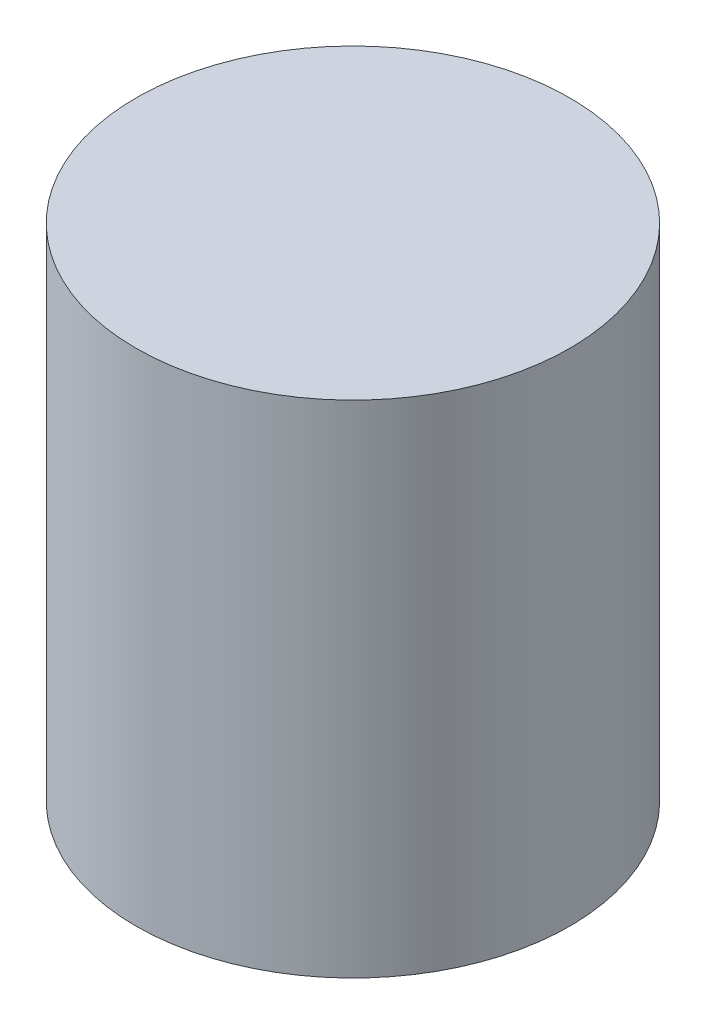
ISO-10303-21;
HEADER;
FILE_DESCRIPTION(('STEP AP214'),'2;1');
FILE_NAME('part.step','',(''),(''),'','','');
FILE_SCHEMA(('AUTOMOTIVE_DESIGN { 1 0 10303 214 1 1 1 1 }'));
ENDSEC;
DATA;
#1=APPLICATION_CONTEXT('core data for automotive mechanical design processes');
#2=APPLICATION_PROTOCOL_DEFINITION('international standard','automotive_design',2000,#1);
#3=PRODUCT_CONTEXT('',#1,'mechanical');
#4=PRODUCT('Part','Part','',(#3));
#5=PRODUCT_RELATED_PRODUCT_CATEGORY('part','',(#4));
#6=PRODUCT_DEFINITION_FORMATION('','',#4);
#7=PRODUCT_DEFINITION_CONTEXT('part definition',#1,'design');
#8=PRODUCT_DEFINITION('design','',#6,#7);
#9=PRODUCT_DEFINITION_SHAPE('','',#8);
#10=(LENGTH_UNIT() NAMED_UNIT(*) SI_UNIT(.MILLI.,.METRE.));
#11=(NAMED_UNIT(*) PLANE_ANGLE_UNIT() SI_UNIT($,.RADIAN.));
#12=(NAMED_UNIT(*) SI_UNIT($,.STERADIAN.) SOLID_ANGLE_UNIT());
#13=UNCERTAINTY_MEASURE_WITH_UNIT(LENGTH_MEASURE(1.E-05),#10,'distance_accuracy_value','');
#14=(GEOMETRIC_REPRESENTATION_CONTEXT(3) GLOBAL_UNCERTAINTY_ASSIGNED_CONTEXT((#13)) GLOBAL_UNIT_ASSIGNED_CONTEXT((#10,
#11,#12)) REPRESENTATION_CONTEXT('',''));
#15=CARTESIAN_POINT('',(0.,0.,0.));
#16=DIRECTION('',(0.,0.,1.));
#17=DIRECTION('',(1.,0.,0.));
#18=AXIS2_PLACEMENT_3D('',#15,#16,#17);
#19=CARTESIAN_POINT('',(0.,15.,0.));
#20=DIRECTION('',(0.,-1.,0.));
#21=DIRECTION('',(0.,0.,-1.));
#22=AXIS2_PLACEMENT_3D('',#19,#20,#21);
#23=CYLINDRICAL_SURFACE('',#22,6.5);
#24=CARTESIAN_POINT('',(0.,15.,0.));
#25=DIRECTION('',(0.,1.,0.));
#26=DIRECTION('',(0.,0.,1.));
#27=AXIS2_PLACEMENT_3D('',#24,#25,#26);
#28=CIRCLE('',#27,6.5);
#29=CARTESIAN_POINT('',(0.,15.,6.5));
#30=VERTEX_POINT('',#29);
#31=EDGE_CURVE('E10',#30,#30,#28,.T.);
#32=ORIENTED_EDGE('',*,*,#31,.F.);
#33=EDGE_LOOP('',(#32));
#34=FACE_BOUND('',#33,.T.);
#35=CARTESIAN_POINT('',(0.,0.,0.));
#36=DIRECTION('',(0.,1.,0.));
#37=DIRECTION('',(0.,0.,1.));
#38=AXIS2_PLACEMENT_3D('',#35,#36,#37);
#39=CIRCLE('',#38,6.5);
#40=CARTESIAN_POINT('',(0.,0.,6.5));
#41=VERTEX_POINT('',#40);
#42=EDGE_CURVE('E40',#41,#41,#39,.T.);
#43=ORIENTED_EDGE('',*,*,#42,.T.);
#44=EDGE_LOOP('',(#43));
#45=FACE_BOUND('',#44,.T.);
#46=ADVANCED_FACE('F37',(#34,#45),#23,.T.);
#47=CARTESIAN_POINT('',(0.,15.,0.));
#48=DIRECTION('',(0.,1.,0.));
#49=DIRECTION('',(0.,0.,1.));
#50=AXIS2_PLACEMENT_3D('',#47,#48,#49);
#51=PLANE('',#50);
#52=ORIENTED_EDGE('',*,*,#31,.T.);
#53=EDGE_LOOP('',(#52));
#54=FACE_BOUND('',#53,.T.);
#55=ADVANCED_FACE('F66',(#54),#51,.T.);
#56=CARTESIAN_POINT('',(0.,0.,0.));
#57=DIRECTION('',(0.,1.,0.));
#58=DIRECTION('',(0.,0.,1.));
#59=AXIS2_PLACEMENT_3D('',#56,#57,#58);
#60=PLANE('',#59);
#61=CARTESIAN_POINT('',(0.,0.,0.));
#62=DIRECTION('',(0.,-1.,0.));
#63=DIRECTION('',(0.,0.,-1.));
#64=AXIS2_PLACEMENT_3D('',#61,#62,#63);
#65=CIRCLE('',#64,3.);
#66=CARTESIAN_POINT('',(0.,0.,-3.));
#67=VERTEX_POINT('',#66);
#68=EDGE_CURVE('E49',#67,#67,#65,.T.);
#69=ORIENTED_EDGE('',*,*,#68,.F.);
#70=EDGE_LOOP('',(#69));
#71=FACE_BOUND('',#70,.T.);
#72=ORIENTED_EDGE('',*,*,#42,.F.);
#73=EDGE_LOOP('',(#72));
#74=FACE_BOUND('',#73,.T.);
#75=ADVANCED_FACE('F60',(#71,#74),#60,.F.);
#76=CARTESIAN_POINT('',(0.,10.,0.));
#77=DIRECTION('',(0.,-1.,0.));
#78=DIRECTION('',(0.,0.,-1.));
#79=AXIS2_PLACEMENT_3D('',#76,#77,#78);
#80=CYLINDRICAL_SURFACE('',#79,3.);
#81=CARTESIAN_POINT('',(0.,10.,0.));
#82=DIRECTION('',(0.,-1.,0.));
#83=DIRECTION('',(0.,0.,-1.));
#84=AXIS2_PLACEMENT_3D('',#81,#82,#83);
#85=CIRCLE('',#84,3.);
#86=CARTESIAN_POINT('',(0.,10.,-3.));
#87=VERTEX_POINT('',#86);
#88=EDGE_CURVE('E47',#87,#87,#85,.T.);
#89=ORIENTED_EDGE('',*,*,#88,.F.);
#90=EDGE_LOOP('',(#89));
#91=FACE_BOUND('',#90,.T.);
#92=ORIENTED_EDGE('',*,*,#68,.T.);
#93=EDGE_LOOP('',(#92));
#94=FACE_BOUND('',#93,.T.);
#95=ADVANCED_FACE('F57',(#91,#94),#80,.F.);
#96=CARTESIAN_POINT('',(0.,10.,0.));
#97=DIRECTION('',(0.,-1.,0.));
#98=DIRECTION('',(0.,0.,-1.));
#99=AXIS2_PLACEMENT_3D('',#96,#97,#98);
#100=PLANE('',#99);
#101=ORIENTED_EDGE('',*,*,#88,.T.);
#102=EDGE_LOOP('',(#101));
#103=FACE_BOUND('',#102,.T.);
#104=ADVANCED_FACE('F55',(#103),#100,.T.);
#105=CLOSED_SHELL('',(#46,#55,#75,#95,#104));
#106=MANIFOLD_SOLID_BREP('B2',#105);
#107=ADVANCED_BREP_SHAPE_REPRESENTATION('',(#18,#106),#14);
#108=SHAPE_DEFINITION_REPRESENTATION(#9,#107);
ENDSEC;
END-ISO-10303-21;
